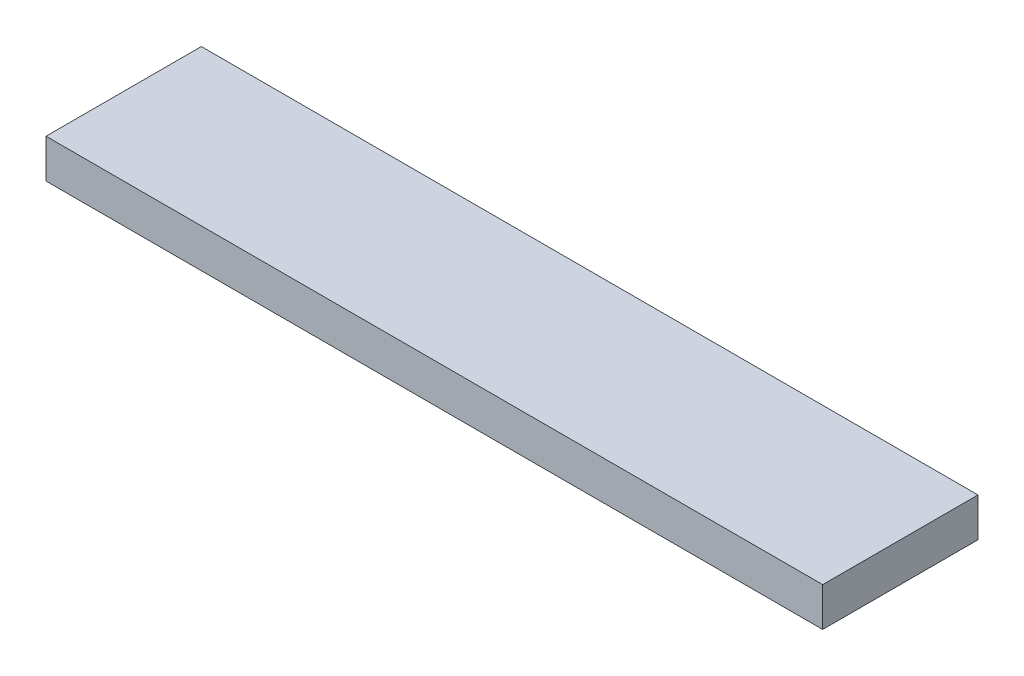
ISO-10303-21;
HEADER;
FILE_DESCRIPTION(('STEP AP214'),'2;1');
FILE_NAME('part.step','',(''),(''),'','','');
FILE_SCHEMA(('AUTOMOTIVE_DESIGN { 1 0 10303 214 1 1 1 1 }'));
ENDSEC;
DATA;
#1=APPLICATION_CONTEXT('core data for automotive mechanical design processes');
#2=APPLICATION_PROTOCOL_DEFINITION('international standard','automotive_design',2000,#1);
#3=PRODUCT_CONTEXT('',#1,'mechanical');
#4=PRODUCT('Part','Part','',(#3));
#5=PRODUCT_RELATED_PRODUCT_CATEGORY('part','',(#4));
#6=PRODUCT_DEFINITION_FORMATION('','',#4);
#7=PRODUCT_DEFINITION_CONTEXT('part definition',#1,'design');
#8=PRODUCT_DEFINITION('design','',#6,#7);
#9=PRODUCT_DEFINITION_SHAPE('','',#8);
#10=(LENGTH_UNIT() NAMED_UNIT(*) SI_UNIT(.MILLI.,.METRE.));
#11=(NAMED_UNIT(*) PLANE_ANGLE_UNIT() SI_UNIT($,.RADIAN.));
#12=(NAMED_UNIT(*) SI_UNIT($,.STERADIAN.) SOLID_ANGLE_UNIT());
#13=UNCERTAINTY_MEASURE_WITH_UNIT(LENGTH_MEASURE(1.E-05),#10,'distance_accuracy_value','');
#14=(GEOMETRIC_REPRESENTATION_CONTEXT(3) GLOBAL_UNCERTAINTY_ASSIGNED_CONTEXT((#13)) GLOBAL_UNIT_ASSIGNED_CONTEXT((#10,
#11,#12)) REPRESENTATION_CONTEXT('',''));
#15=CARTESIAN_POINT('',(0.,0.,0.));
#16=DIRECTION('',(0.,0.,1.));
#17=DIRECTION('',(1.,0.,0.));
#18=AXIS2_PLACEMENT_3D('',#15,#16,#17);
#19=CARTESIAN_POINT('',(63.5,6.35,12.7));
#20=DIRECTION('',(-1.,0.,0.));
#21=DIRECTION('',(0.,0.,1.));
#22=AXIS2_PLACEMENT_3D('',#19,#20,#21);
#23=PLANE('',#22);
#24=DIRECTION('',(0.,0.,-1.));
#25=VECTOR('',#24,1.);
#26=CARTESIAN_POINT('',(63.5,0.,12.7));
#27=LINE('',#26,#25);
#28=CARTESIAN_POINT('',(63.5,0.,12.7));
#29=VERTEX_POINT('',#28);
#30=CARTESIAN_POINT('',(63.5,0.,-12.7));
#31=VERTEX_POINT('',#30);
#32=EDGE_CURVE('E95',#29,#31,#27,.T.);
#33=ORIENTED_EDGE('',*,*,#32,.T.);
#34=DIRECTION('',(0.,-1.,0.));
#35=VECTOR('',#34,1.);
#36=CARTESIAN_POINT('',(63.5,6.35,-12.7));
#37=LINE('',#36,#35);
#38=CARTESIAN_POINT('',(63.5,6.35,-12.7));
#39=VERTEX_POINT('',#38);
#40=EDGE_CURVE('E11',#39,#31,#37,.T.);
#41=ORIENTED_EDGE('',*,*,#40,.F.);
#42=DIRECTION('',(0.,0.,-1.));
#43=VECTOR('',#42,1.);
#44=CARTESIAN_POINT('',(63.5,6.35,12.7));
#45=LINE('',#44,#43);
#46=CARTESIAN_POINT('',(63.5,6.35,12.7));
#47=VERTEX_POINT('',#46);
#48=EDGE_CURVE('E83',#47,#39,#45,.T.);
#49=ORIENTED_EDGE('',*,*,#48,.F.);
#50=DIRECTION('',(0.,-1.,0.));
#51=VECTOR('',#50,1.);
#52=CARTESIAN_POINT('',(63.5,6.35,12.7));
#53=LINE('',#52,#51);
#54=EDGE_CURVE('E91',#47,#29,#53,.T.);
#55=ORIENTED_EDGE('',*,*,#54,.T.);
#56=EDGE_LOOP('',(#33,#41,#49,#55));
#57=FACE_BOUND('',#56,.T.);
#58=ADVANCED_FACE('F32',(#57),#23,.F.);
#59=CARTESIAN_POINT('',(-63.5,6.35,-12.7));
#60=DIRECTION('',(0.,0.,1.));
#61=DIRECTION('',(1.,0.,0.));
#62=AXIS2_PLACEMENT_3D('',#59,#60,#61);
#63=PLANE('',#62);
#64=DIRECTION('',(-1.,0.,0.));
#65=VECTOR('',#64,1.);
#66=CARTESIAN_POINT('',(-63.5,0.,-12.7));
#67=LINE('',#66,#65);
#68=CARTESIAN_POINT('',(-63.5,0.,-12.7));
#69=VERTEX_POINT('',#68);
#70=EDGE_CURVE('E87',#31,#69,#67,.T.);
#71=ORIENTED_EDGE('',*,*,#70,.T.);
#72=DIRECTION('',(0.,-1.,0.));
#73=VECTOR('',#72,1.);
#74=CARTESIAN_POINT('',(-63.5,6.35,-12.7));
#75=LINE('',#74,#73);
#76=CARTESIAN_POINT('',(-63.5,6.35,-12.7));
#77=VERTEX_POINT('',#76);
#78=EDGE_CURVE('E40',#77,#69,#75,.T.);
#79=ORIENTED_EDGE('',*,*,#78,.F.);
#80=DIRECTION('',(-1.,0.,0.));
#81=VECTOR('',#80,1.);
#82=CARTESIAN_POINT('',(-63.5,6.35,-12.7));
#83=LINE('',#82,#81);
#84=EDGE_CURVE('E78',#39,#77,#83,.T.);
#85=ORIENTED_EDGE('',*,*,#84,.F.);
#86=ORIENTED_EDGE('',*,*,#40,.T.);
#87=EDGE_LOOP('',(#71,#79,#85,#86));
#88=FACE_BOUND('',#87,.T.);
#89=ADVANCED_FACE('F86',(#88),#63,.F.);
#90=CARTESIAN_POINT('',(-63.5,6.35,12.7));
#91=DIRECTION('',(1.,0.,0.));
#92=DIRECTION('',(0.,0.,-1.));
#93=AXIS2_PLACEMENT_3D('',#90,#91,#92);
#94=PLANE('',#93);
#95=DIRECTION('',(0.,0.,1.));
#96=VECTOR('',#95,1.);
#97=CARTESIAN_POINT('',(-63.5,0.,12.7));
#98=LINE('',#97,#96);
#99=CARTESIAN_POINT('',(-63.5,0.,12.7));
#100=VERTEX_POINT('',#99);
#101=EDGE_CURVE('E65',#69,#100,#98,.T.);
#102=ORIENTED_EDGE('',*,*,#101,.T.);
#103=DIRECTION('',(0.,-1.,0.));
#104=VECTOR('',#103,1.);
#105=CARTESIAN_POINT('',(-63.5,6.35,12.7));
#106=LINE('',#105,#104);
#107=CARTESIAN_POINT('',(-63.5,6.35,12.7));
#108=VERTEX_POINT('',#107);
#109=EDGE_CURVE('E88',#108,#100,#106,.T.);
#110=ORIENTED_EDGE('',*,*,#109,.F.);
#111=DIRECTION('',(0.,0.,1.));
#112=VECTOR('',#111,1.);
#113=CARTESIAN_POINT('',(-63.5,6.35,12.7));
#114=LINE('',#113,#112);
#115=EDGE_CURVE('E81',#77,#108,#114,.T.);
#116=ORIENTED_EDGE('',*,*,#115,.F.);
#117=ORIENTED_EDGE('',*,*,#78,.T.);
#118=EDGE_LOOP('',(#102,#110,#116,#117));
#119=FACE_BOUND('',#118,.T.);
#120=ADVANCED_FACE('F89',(#119),#94,.F.);
#121=CARTESIAN_POINT('',(-63.5,6.35,12.7));
#122=DIRECTION('',(0.,0.,-1.));
#123=DIRECTION('',(-1.,0.,0.));
#124=AXIS2_PLACEMENT_3D('',#121,#122,#123);
#125=PLANE('',#124);
#126=DIRECTION('',(1.,0.,0.));
#127=VECTOR('',#126,1.);
#128=CARTESIAN_POINT('',(-63.5,0.,12.7));
#129=LINE('',#128,#127);
#130=EDGE_CURVE('E71',#100,#29,#129,.T.);
#131=ORIENTED_EDGE('',*,*,#130,.T.);
#132=ORIENTED_EDGE('',*,*,#54,.F.);
#133=DIRECTION('',(1.,0.,0.));
#134=VECTOR('',#133,1.);
#135=CARTESIAN_POINT('',(-63.5,6.35,12.7));
#136=LINE('',#135,#134);
#137=EDGE_CURVE('E48',#108,#47,#136,.T.);
#138=ORIENTED_EDGE('',*,*,#137,.F.);
#139=ORIENTED_EDGE('',*,*,#109,.T.);
#140=EDGE_LOOP('',(#131,#132,#138,#139));
#141=FACE_BOUND('',#140,.T.);
#142=ADVANCED_FACE('F102',(#141),#125,.F.);
#143=CARTESIAN_POINT('',(0.,6.35,0.));
#144=DIRECTION('',(0.,-1.,0.));
#145=DIRECTION('',(0.,0.,-1.));
#146=AXIS2_PLACEMENT_3D('',#143,#144,#145);
#147=PLANE('',#146);
#148=ORIENTED_EDGE('',*,*,#48,.T.);
#149=ORIENTED_EDGE('',*,*,#84,.T.);
#150=ORIENTED_EDGE('',*,*,#115,.T.);
#151=ORIENTED_EDGE('',*,*,#137,.T.);
#152=EDGE_LOOP('',(#148,#149,#150,#151));
#153=FACE_BOUND('',#152,.T.);
#154=ADVANCED_FACE('F79',(#153),#147,.F.);
#155=CARTESIAN_POINT('',(0.,0.,0.));
#156=DIRECTION('',(0.,-1.,0.));
#157=DIRECTION('',(0.,0.,-1.));
#158=AXIS2_PLACEMENT_3D('',#155,#156,#157);
#159=PLANE('',#158);
#160=ORIENTED_EDGE('',*,*,#32,.F.);
#161=ORIENTED_EDGE('',*,*,#130,.F.);
#162=ORIENTED_EDGE('',*,*,#101,.F.);
#163=ORIENTED_EDGE('',*,*,#70,.F.);
#164=EDGE_LOOP('',(#160,#161,#162,#163));
#165=FACE_BOUND('',#164,.T.);
#166=ADVANCED_FACE('F105',(#165),#159,.T.);
#167=CLOSED_SHELL('',(#58,#89,#120,#142,#154,#166));
#168=MANIFOLD_SOLID_BREP('B2',#167);
#169=ADVANCED_BREP_SHAPE_REPRESENTATION('',(#18,#168),#14);
#170=SHAPE_DEFINITION_REPRESENTATION(#9,#169);
ENDSEC;
END-ISO-10303-21;
